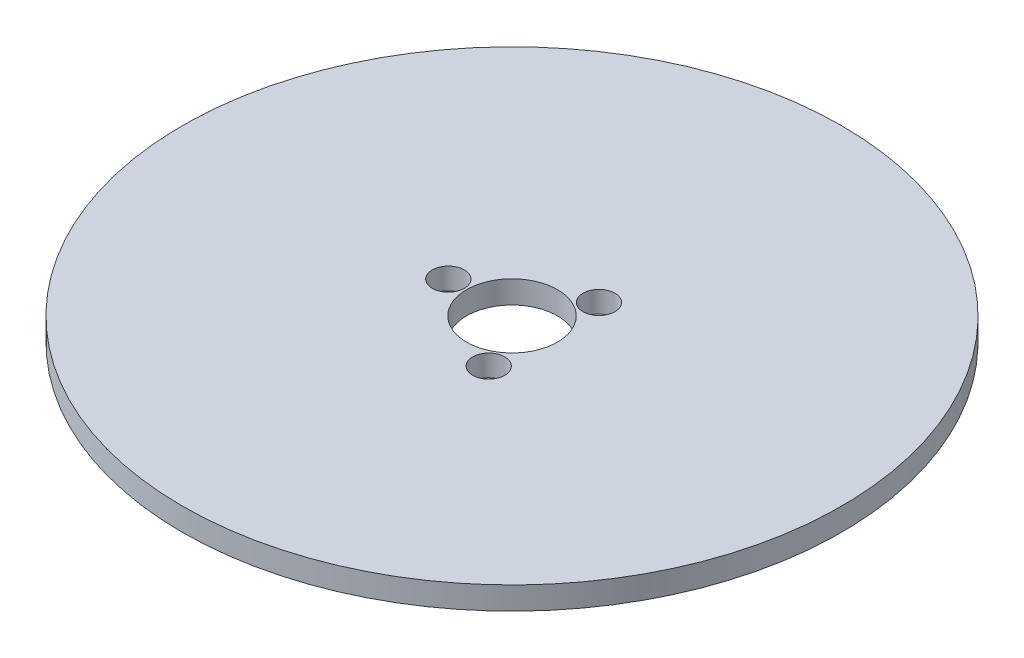
ISO-10303-21;
HEADER;
FILE_DESCRIPTION(('STEP AP214'),'2;1');
FILE_NAME('part.step','',(''),(''),'','','');
FILE_SCHEMA(('AUTOMOTIVE_DESIGN { 1 0 10303 214 1 1 1 1 }'));
ENDSEC;
DATA;
#1=APPLICATION_CONTEXT('core data for automotive mechanical design processes');
#2=APPLICATION_PROTOCOL_DEFINITION('international standard','automotive_design',2000,#1);
#3=PRODUCT_CONTEXT('',#1,'mechanical');
#4=PRODUCT('Part','Part','',(#3));
#5=PRODUCT_RELATED_PRODUCT_CATEGORY('part','',(#4));
#6=PRODUCT_DEFINITION_FORMATION('','',#4);
#7=PRODUCT_DEFINITION_CONTEXT('part definition',#1,'design');
#8=PRODUCT_DEFINITION('design','',#6,#7);
#9=PRODUCT_DEFINITION_SHAPE('','',#8);
#10=(LENGTH_UNIT() NAMED_UNIT(*) SI_UNIT(.MILLI.,.METRE.));
#11=(NAMED_UNIT(*) PLANE_ANGLE_UNIT() SI_UNIT($,.RADIAN.));
#12=(NAMED_UNIT(*) SI_UNIT($,.STERADIAN.) SOLID_ANGLE_UNIT());
#13=UNCERTAINTY_MEASURE_WITH_UNIT(LENGTH_MEASURE(1.E-05),#10,'distance_accuracy_value','');
#14=(GEOMETRIC_REPRESENTATION_CONTEXT(3) GLOBAL_UNCERTAINTY_ASSIGNED_CONTEXT((#13)) GLOBAL_UNIT_ASSIGNED_CONTEXT((#10,
#11,#12)) REPRESENTATION_CONTEXT('',''));
#15=CARTESIAN_POINT('',(0.,0.,0.));
#16=DIRECTION('',(0.,0.,1.));
#17=DIRECTION('',(1.,0.,0.));
#18=AXIS2_PLACEMENT_3D('',#15,#16,#17);
#19=CARTESIAN_POINT('',(0.,5.,0.));
#20=DIRECTION('',(0.,-1.,0.));
#21=DIRECTION('',(0.,0.,-1.));
#22=AXIS2_PLACEMENT_3D('',#19,#20,#21);
#23=CYLINDRICAL_SURFACE('',#22,72.5);
#24=CARTESIAN_POINT('',(0.,5.,0.));
#25=DIRECTION('',(0.,1.,0.));
#26=DIRECTION('',(0.,0.,1.));
#27=AXIS2_PLACEMENT_3D('',#24,#25,#26);
#28=CIRCLE('',#27,72.5);
#29=CARTESIAN_POINT('',(0.,5.,72.5));
#30=VERTEX_POINT('',#29);
#31=EDGE_CURVE('E10',#30,#30,#28,.T.);
#32=ORIENTED_EDGE('',*,*,#31,.F.);
#33=EDGE_LOOP('',(#32));
#34=FACE_BOUND('',#33,.T.);
#35=CARTESIAN_POINT('',(0.,0.,0.));
#36=DIRECTION('',(0.,1.,0.));
#37=DIRECTION('',(0.,0.,1.));
#38=AXIS2_PLACEMENT_3D('',#35,#36,#37);
#39=CIRCLE('',#38,72.5);
#40=CARTESIAN_POINT('',(0.,0.,72.5));
#41=VERTEX_POINT('',#40);
#42=EDGE_CURVE('E37',#41,#41,#39,.T.);
#43=ORIENTED_EDGE('',*,*,#42,.T.);
#44=EDGE_LOOP('',(#43));
#45=FACE_BOUND('',#44,.T.);
#46=ADVANCED_FACE('F40',(#34,#45),#23,.T.);
#47=CARTESIAN_POINT('',(0.,5.,0.));
#48=DIRECTION('',(0.,1.,0.));
#49=DIRECTION('',(0.,0.,1.));
#50=AXIS2_PLACEMENT_3D('',#47,#48,#49);
#51=PLANE('',#50);
#52=CARTESIAN_POINT('',(7.00262300025883,5.,12.1288988226986));
#53=DIRECTION('',(0.,1.,0.));
#54=DIRECTION('',(0.866025403784436,0.,-0.500000000000004));
#55=AXIS2_PLACEMENT_3D('',#52,#53,#54);
#56=CIRCLE('',#55,3.52501737792676);
#57=CARTESIAN_POINT('',(10.055377598325,5.,10.3663901337352));
#58=VERTEX_POINT('',#57);
#59=EDGE_CURVE('E70',#58,#58,#56,.T.);
#60=ORIENTED_EDGE('',*,*,#59,.F.);
#61=EDGE_LOOP('',(#60));
#62=FACE_BOUND('',#61,.T.);
#63=CARTESIAN_POINT('',(7.00262300025866,5.,-12.1288988226987));
#64=DIRECTION('',(0.,1.,0.));
#65=DIRECTION('',(-0.866025403784443,0.,-0.499999999999992));
#66=AXIS2_PLACEMENT_3D('',#63,#64,#65);
#67=CIRCLE('',#66,3.52501737792676);
#68=CARTESIAN_POINT('',(3.94986840219246,5.,-13.891407511662));
#69=VERTEX_POINT('',#68);
#70=EDGE_CURVE('E61',#69,#69,#67,.T.);
#71=ORIENTED_EDGE('',*,*,#70,.F.);
#72=EDGE_LOOP('',(#71));
#73=FACE_BOUND('',#72,.T.);
#74=CARTESIAN_POINT('',(-14.0052460005175,5.,0.));
#75=DIRECTION('',(0.,1.,0.));
#76=DIRECTION('',(0.,0.,1.));
#77=AXIS2_PLACEMENT_3D('',#74,#75,#76);
#78=CIRCLE('',#77,3.52501737792676);
#79=CARTESIAN_POINT('',(-14.0052460005175,5.,3.52501737792676));
#80=VERTEX_POINT('',#79);
#81=EDGE_CURVE('E54',#80,#80,#78,.T.);
#82=ORIENTED_EDGE('',*,*,#81,.F.);
#83=EDGE_LOOP('',(#82));
#84=FACE_BOUND('',#83,.T.);
#85=CARTESIAN_POINT('',(0.,5.,0.));
#86=DIRECTION('',(0.,1.,0.));
#87=DIRECTION('',(0.,0.,1.));
#88=AXIS2_PLACEMENT_3D('',#85,#86,#87);
#89=CIRCLE('',#88,10.);
#90=CARTESIAN_POINT('',(0.,5.,10.));
#91=VERTEX_POINT('',#90);
#92=EDGE_CURVE('E50',#91,#91,#89,.T.);
#93=ORIENTED_EDGE('',*,*,#92,.F.);
#94=EDGE_LOOP('',(#93));
#95=FACE_BOUND('',#94,.T.);
#96=ORIENTED_EDGE('',*,*,#31,.T.);
#97=EDGE_LOOP('',(#96));
#98=FACE_BOUND('',#97,.T.);
#99=ADVANCED_FACE('F85',(#62,#73,#84,#95,#98),#51,.T.);
#100=CARTESIAN_POINT('',(0.,0.,0.));
#101=DIRECTION('',(0.,1.,0.));
#102=DIRECTION('',(0.,0.,1.));
#103=AXIS2_PLACEMENT_3D('',#100,#101,#102);
#104=PLANE('',#103);
#105=CARTESIAN_POINT('',(0.,0.,0.));
#106=DIRECTION('',(0.,1.,0.));
#107=DIRECTION('',(0.,0.,1.));
#108=AXIS2_PLACEMENT_3D('',#105,#106,#107);
#109=CIRCLE('',#108,10.);
#110=CARTESIAN_POINT('',(0.,0.,10.));
#111=VERTEX_POINT('',#110);
#112=EDGE_CURVE('E47',#111,#111,#109,.T.);
#113=ORIENTED_EDGE('',*,*,#112,.T.);
#114=EDGE_LOOP('',(#113));
#115=FACE_BOUND('',#114,.T.);
#116=ORIENTED_EDGE('',*,*,#42,.F.);
#117=EDGE_LOOP('',(#116));
#118=FACE_BOUND('',#117,.T.);
#119=ADVANCED_FACE('F84',(#115,#118),#104,.F.);
#120=CARTESIAN_POINT('',(0.,5.,0.));
#121=DIRECTION('',(0.,-1.,0.));
#122=DIRECTION('',(0.,0.,-1.));
#123=AXIS2_PLACEMENT_3D('',#120,#121,#122);
#124=CYLINDRICAL_SURFACE('',#123,10.);
#125=ORIENTED_EDGE('',*,*,#92,.T.);
#126=EDGE_LOOP('',(#125));
#127=FACE_BOUND('',#126,.T.);
#128=ORIENTED_EDGE('',*,*,#112,.F.);
#129=EDGE_LOOP('',(#128));
#130=FACE_BOUND('',#129,.T.);
#131=ADVANCED_FACE('F91',(#127,#130),#124,.F.);
#132=CARTESIAN_POINT('',(-14.0052460005175,0.291983884236464,0.));
#133=DIRECTION('',(0.,1.,0.));
#134=DIRECTION('',(0.,0.,1.));
#135=AXIS2_PLACEMENT_3D('',#132,#133,#134);
#136=CYLINDRICAL_SURFACE('',#135,3.52501737792676);
#137=CARTESIAN_POINT('',(-14.0052460005175,0.291983884236464,0.));
#138=DIRECTION('',(0.,1.,0.));
#139=DIRECTION('',(0.,0.,1.));
#140=AXIS2_PLACEMENT_3D('',#137,#138,#139);
#141=CIRCLE('',#140,3.52501737792676);
#142=CARTESIAN_POINT('',(-14.0052460005175,0.291983884236464,3.52501737792676));
#143=VERTEX_POINT('',#142);
#144=EDGE_CURVE('E55',#143,#143,#141,.T.);
#145=ORIENTED_EDGE('',*,*,#144,.F.);
#146=EDGE_LOOP('',(#145));
#147=FACE_BOUND('',#146,.T.);
#148=ORIENTED_EDGE('',*,*,#81,.T.);
#149=EDGE_LOOP('',(#148));
#150=FACE_BOUND('',#149,.T.);
#151=ADVANCED_FACE('F96',(#147,#150),#136,.F.);
#152=CARTESIAN_POINT('',(-14.0052460005175,0.291983884236464,0.));
#153=DIRECTION('',(0.,1.,0.));
#154=DIRECTION('',(0.,0.,1.));
#155=AXIS2_PLACEMENT_3D('',#152,#153,#154);
#156=PLANE('',#155);
#157=ORIENTED_EDGE('',*,*,#144,.T.);
#158=EDGE_LOOP('',(#157));
#159=FACE_BOUND('',#158,.T.);
#160=ADVANCED_FACE('F127',(#159),#156,.T.);
#161=CARTESIAN_POINT('',(7.00262300025866,0.291983884236464,-12.1288988226987));
#162=DIRECTION('',(0.,1.,0.));
#163=DIRECTION('',(0.,0.,1.));
#164=AXIS2_PLACEMENT_3D('',#161,#162,#163);
#165=CYLINDRICAL_SURFACE('',#164,3.52501737792676);
#166=CARTESIAN_POINT('',(7.00262300025866,0.291983884236464,-12.1288988226987));
#167=DIRECTION('',(0.,1.,0.));
#168=DIRECTION('',(-0.866025403784443,0.,-0.499999999999992));
#169=AXIS2_PLACEMENT_3D('',#166,#167,#168);
#170=CIRCLE('',#169,3.52501737792676);
#171=CARTESIAN_POINT('',(3.94986840219246,0.291983884236464,-13.891407511662));
#172=VERTEX_POINT('',#171);
#173=EDGE_CURVE('E63',#172,#172,#170,.T.);
#174=ORIENTED_EDGE('',*,*,#173,.F.);
#175=EDGE_LOOP('',(#174));
#176=FACE_BOUND('',#175,.T.);
#177=ORIENTED_EDGE('',*,*,#70,.T.);
#178=EDGE_LOOP('',(#177));
#179=FACE_BOUND('',#178,.T.);
#180=ADVANCED_FACE('F133',(#176,#179),#165,.F.);
#181=CARTESIAN_POINT('',(7.00262300025866,0.291983884236464,-12.1288988226987));
#182=DIRECTION('',(0.,1.,0.));
#183=DIRECTION('',(-0.866025403784443,0.,-0.499999999999992));
#184=AXIS2_PLACEMENT_3D('',#181,#182,#183);
#185=PLANE('',#184);
#186=ORIENTED_EDGE('',*,*,#173,.T.);
#187=EDGE_LOOP('',(#186));
#188=FACE_BOUND('',#187,.T.);
#189=ADVANCED_FACE('F77',(#188),#185,.T.);
#190=CARTESIAN_POINT('',(7.00262300025883,0.291983884236464,12.1288988226986));
#191=DIRECTION('',(0.,1.,0.));
#192=DIRECTION('',(0.,0.,1.));
#193=AXIS2_PLACEMENT_3D('',#190,#191,#192);
#194=CYLINDRICAL_SURFACE('',#193,3.52501737792676);
#195=CARTESIAN_POINT('',(7.00262300025883,0.291983884236464,12.1288988226986));
#196=DIRECTION('',(0.,1.,0.));
#197=DIRECTION('',(0.866025403784436,0.,-0.500000000000004));
#198=AXIS2_PLACEMENT_3D('',#195,#196,#197);
#199=CIRCLE('',#198,3.52501737792676);
#200=CARTESIAN_POINT('',(10.055377598325,0.291983884236464,10.3663901337352));
#201=VERTEX_POINT('',#200);
#202=EDGE_CURVE('E59',#201,#201,#199,.T.);
#203=ORIENTED_EDGE('',*,*,#202,.F.);
#204=EDGE_LOOP('',(#203));
#205=FACE_BOUND('',#204,.T.);
#206=ORIENTED_EDGE('',*,*,#59,.T.);
#207=EDGE_LOOP('',(#206));
#208=FACE_BOUND('',#207,.T.);
#209=ADVANCED_FACE('F73',(#205,#208),#194,.F.);
#210=CARTESIAN_POINT('',(7.00262300025883,0.291983884236464,12.1288988226986));
#211=DIRECTION('',(0.,1.,0.));
#212=DIRECTION('',(0.866025403784436,0.,-0.500000000000004));
#213=AXIS2_PLACEMENT_3D('',#210,#211,#212);
#214=PLANE('',#213);
#215=ORIENTED_EDGE('',*,*,#202,.T.);
#216=EDGE_LOOP('',(#215));
#217=FACE_BOUND('',#216,.T.);
#218=ADVANCED_FACE('F71',(#217),#214,.T.);
#219=CLOSED_SHELL('',(#46,#99,#119,#131,#151,#160,#180,#189,#209,#218));
#220=MANIFOLD_SOLID_BREP('B2',#219);
#221=ADVANCED_BREP_SHAPE_REPRESENTATION('',(#18,#220),#14);
#222=SHAPE_DEFINITION_REPRESENTATION(#9,#221);
ENDSEC;
END-ISO-10303-21;
